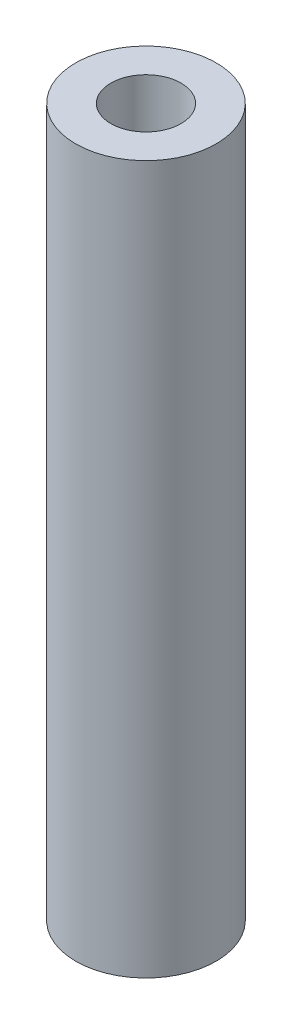
ISO-10303-21;
HEADER;
FILE_DESCRIPTION(('STEP AP214'),'2;1');
FILE_NAME('part.step','',(''),(''),'','','');
FILE_SCHEMA(('AUTOMOTIVE_DESIGN { 1 0 10303 214 1 1 1 1 }'));
ENDSEC;
DATA;
#1=APPLICATION_CONTEXT('core data for automotive mechanical design processes');
#2=APPLICATION_PROTOCOL_DEFINITION('international standard','automotive_design',2000,#1);
#3=PRODUCT_CONTEXT('',#1,'mechanical');
#4=PRODUCT('Part','Part','',(#3));
#5=PRODUCT_RELATED_PRODUCT_CATEGORY('part','',(#4));
#6=PRODUCT_DEFINITION_FORMATION('','',#4);
#7=PRODUCT_DEFINITION_CONTEXT('part definition',#1,'design');
#8=PRODUCT_DEFINITION('design','',#6,#7);
#9=PRODUCT_DEFINITION_SHAPE('','',#8);
#10=(LENGTH_UNIT() NAMED_UNIT(*) SI_UNIT(.MILLI.,.METRE.));
#11=(NAMED_UNIT(*) PLANE_ANGLE_UNIT() SI_UNIT($,.RADIAN.));
#12=(NAMED_UNIT(*) SI_UNIT($,.STERADIAN.) SOLID_ANGLE_UNIT());
#13=UNCERTAINTY_MEASURE_WITH_UNIT(LENGTH_MEASURE(1.E-05),#10,'distance_accuracy_value','');
#14=(GEOMETRIC_REPRESENTATION_CONTEXT(3) GLOBAL_UNCERTAINTY_ASSIGNED_CONTEXT((#13)) GLOBAL_UNIT_ASSIGNED_CONTEXT((#10,
#11,#12)) REPRESENTATION_CONTEXT('',''));
#15=CARTESIAN_POINT('',(0.,0.,0.));
#16=DIRECTION('',(0.,0.,1.));
#17=DIRECTION('',(1.,0.,0.));
#18=AXIS2_PLACEMENT_3D('',#15,#16,#17);
#19=CARTESIAN_POINT('',(0.,63.99784,0.));
#20=DIRECTION('',(0.,1.,0.));
#21=DIRECTION('',(0.,0.,1.));
#22=AXIS2_PLACEMENT_3D('',#19,#20,#21);
#23=PLANE('',#22);
#24=CARTESIAN_POINT('',(0.,63.99784,0.));
#25=DIRECTION('',(0.,1.,0.));
#26=DIRECTION('',(0.,0.,1.));
#27=AXIS2_PLACEMENT_3D('',#24,#25,#26);
#28=CIRCLE('',#27,6.35);
#29=CARTESIAN_POINT('',(0.,63.99784,6.35));
#30=VERTEX_POINT('',#29);
#31=EDGE_CURVE('E10',#30,#30,#28,.T.);
#32=ORIENTED_EDGE('',*,*,#31,.T.);
#33=EDGE_LOOP('',(#32));
#34=FACE_BOUND('',#33,.T.);
#35=CARTESIAN_POINT('',(0.,63.99784,0.));
#36=DIRECTION('',(0.,1.,0.));
#37=DIRECTION('',(0.,0.,1.));
#38=AXIS2_PLACEMENT_3D('',#35,#36,#37);
#39=CIRCLE('',#38,3.175);
#40=CARTESIAN_POINT('',(0.,63.99784,3.175));
#41=VERTEX_POINT('',#40);
#42=EDGE_CURVE('E47',#41,#41,#39,.T.);
#43=ORIENTED_EDGE('',*,*,#42,.F.);
#44=EDGE_LOOP('',(#43));
#45=FACE_BOUND('',#44,.T.);
#46=ADVANCED_FACE('F34',(#34,#45),#23,.T.);
#47=CARTESIAN_POINT('',(0.,0.,0.));
#48=DIRECTION('',(0.,1.,0.));
#49=DIRECTION('',(0.,0.,1.));
#50=AXIS2_PLACEMENT_3D('',#47,#48,#49);
#51=PLANE('',#50);
#52=CARTESIAN_POINT('',(0.,0.,0.));
#53=DIRECTION('',(0.,1.,0.));
#54=DIRECTION('',(0.,0.,1.));
#55=AXIS2_PLACEMENT_3D('',#52,#53,#54);
#56=CIRCLE('',#55,6.35);
#57=CARTESIAN_POINT('',(0.,0.,6.35));
#58=VERTEX_POINT('',#57);
#59=EDGE_CURVE('E38',#58,#58,#56,.T.);
#60=ORIENTED_EDGE('',*,*,#59,.F.);
#61=EDGE_LOOP('',(#60));
#62=FACE_BOUND('',#61,.T.);
#63=CARTESIAN_POINT('',(0.,0.,0.));
#64=DIRECTION('',(0.,1.,0.));
#65=DIRECTION('',(0.,0.,1.));
#66=AXIS2_PLACEMENT_3D('',#63,#64,#65);
#67=CIRCLE('',#66,3.175);
#68=CARTESIAN_POINT('',(0.,0.,3.175));
#69=VERTEX_POINT('',#68);
#70=EDGE_CURVE('E49',#69,#69,#67,.T.);
#71=ORIENTED_EDGE('',*,*,#70,.T.);
#72=EDGE_LOOP('',(#71));
#73=FACE_BOUND('',#72,.T.);
#74=ADVANCED_FACE('F59',(#62,#73),#51,.F.);
#75=CARTESIAN_POINT('',(0.,63.99784,0.));
#76=DIRECTION('',(0.,-1.,0.));
#77=DIRECTION('',(0.,0.,-1.));
#78=AXIS2_PLACEMENT_3D('',#75,#76,#77);
#79=CYLINDRICAL_SURFACE('',#78,6.35);
#80=ORIENTED_EDGE('',*,*,#31,.F.);
#81=EDGE_LOOP('',(#80));
#82=FACE_BOUND('',#81,.T.);
#83=ORIENTED_EDGE('',*,*,#59,.T.);
#84=EDGE_LOOP('',(#83));
#85=FACE_BOUND('',#84,.T.);
#86=ADVANCED_FACE('F36',(#82,#85),#79,.T.);
#87=CARTESIAN_POINT('',(0.,63.99784,0.));
#88=DIRECTION('',(0.,-1.,0.));
#89=DIRECTION('',(0.,0.,-1.));
#90=AXIS2_PLACEMENT_3D('',#87,#88,#89);
#91=CYLINDRICAL_SURFACE('',#90,3.175);
#92=ORIENTED_EDGE('',*,*,#42,.T.);
#93=EDGE_LOOP('',(#92));
#94=FACE_BOUND('',#93,.T.);
#95=ORIENTED_EDGE('',*,*,#70,.F.);
#96=EDGE_LOOP('',(#95));
#97=FACE_BOUND('',#96,.T.);
#98=ADVANCED_FACE('F55',(#94,#97),#91,.F.);
#99=CLOSED_SHELL('',(#46,#74,#86,#98));
#100=MANIFOLD_SOLID_BREP('B2',#99);
#101=ADVANCED_BREP_SHAPE_REPRESENTATION('',(#18,#100),#14);
#102=SHAPE_DEFINITION_REPRESENTATION(#9,#101);
ENDSEC;
END-ISO-10303-21;
